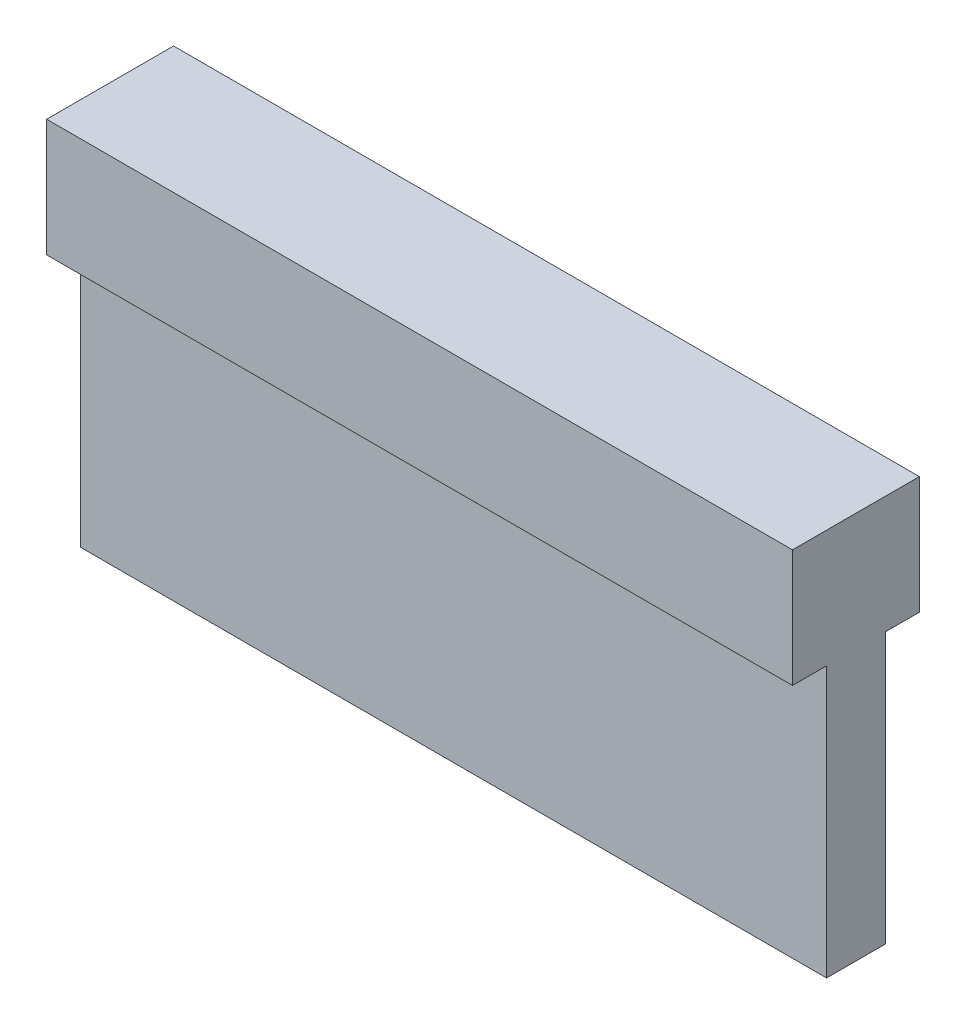
ISO-10303-21;
HEADER;
FILE_DESCRIPTION(('STEP AP214'),'2;1');
FILE_NAME('part.step','',(''),(''),'','','');
FILE_SCHEMA(('AUTOMOTIVE_DESIGN { 1 0 10303 214 1 1 1 1 }'));
ENDSEC;
DATA;
#1=APPLICATION_CONTEXT('core data for automotive mechanical design processes');
#2=APPLICATION_PROTOCOL_DEFINITION('international standard','automotive_design',2000,#1);
#3=PRODUCT_CONTEXT('',#1,'mechanical');
#4=PRODUCT('Part','Part','',(#3));
#5=PRODUCT_RELATED_PRODUCT_CATEGORY('part','',(#4));
#6=PRODUCT_DEFINITION_FORMATION('','',#4);
#7=PRODUCT_DEFINITION_CONTEXT('part definition',#1,'design');
#8=PRODUCT_DEFINITION('design','',#6,#7);
#9=PRODUCT_DEFINITION_SHAPE('','',#8);
#10=(LENGTH_UNIT() NAMED_UNIT(*) SI_UNIT(.MILLI.,.METRE.));
#11=(NAMED_UNIT(*) PLANE_ANGLE_UNIT() SI_UNIT($,.RADIAN.));
#12=(NAMED_UNIT(*) SI_UNIT($,.STERADIAN.) SOLID_ANGLE_UNIT());
#13=UNCERTAINTY_MEASURE_WITH_UNIT(LENGTH_MEASURE(1.E-05),#10,'distance_accuracy_value','');
#14=(GEOMETRIC_REPRESENTATION_CONTEXT(3) GLOBAL_UNCERTAINTY_ASSIGNED_CONTEXT((#13)) GLOBAL_UNIT_ASSIGNED_CONTEXT((#10,
#11,#12)) REPRESENTATION_CONTEXT('',''));
#15=CARTESIAN_POINT('',(0.,0.,0.));
#16=DIRECTION('',(0.,0.,1.));
#17=DIRECTION('',(1.,0.,0.));
#18=AXIS2_PLACEMENT_3D('',#15,#16,#17);
#19=CARTESIAN_POINT('',(31.75,-2.5,-1.25));
#20=DIRECTION('',(0.,1.,0.));
#21=DIRECTION('',(0.,0.,1.));
#22=AXIS2_PLACEMENT_3D('',#19,#20,#21);
#23=PLANE('',#22);
#24=DIRECTION('',(0.,0.,-1.));
#25=VECTOR('',#24,1.);
#26=CARTESIAN_POINT('',(0.,-2.5,-1.25));
#27=LINE('',#26,#25);
#28=CARTESIAN_POINT('',(0.,-2.5,-1.25));
#29=VERTEX_POINT('',#28);
#30=CARTESIAN_POINT('',(0.,-2.5,-2.70000000000002));
#31=VERTEX_POINT('',#30);
#32=EDGE_CURVE('E131',#29,#31,#27,.T.);
#33=ORIENTED_EDGE('',*,*,#32,.T.);
#34=DIRECTION('',(-1.,0.,0.));
#35=VECTOR('',#34,1.);
#36=CARTESIAN_POINT('',(31.75,-2.5,-2.70000000000002));
#37=LINE('',#36,#35);
#38=CARTESIAN_POINT('',(31.75,-2.5,-2.70000000000002));
#39=VERTEX_POINT('',#38);
#40=EDGE_CURVE('E11',#39,#31,#37,.T.);
#41=ORIENTED_EDGE('',*,*,#40,.F.);
#42=DIRECTION('',(0.,0.,-1.));
#43=VECTOR('',#42,1.);
#44=CARTESIAN_POINT('',(31.75,-2.5,-1.25));
#45=LINE('',#44,#43);
#46=CARTESIAN_POINT('',(31.75,-2.5,-1.25));
#47=VERTEX_POINT('',#46);
#48=EDGE_CURVE('E145',#47,#39,#45,.T.);
#49=ORIENTED_EDGE('',*,*,#48,.F.);
#50=DIRECTION('',(-1.,0.,0.));
#51=VECTOR('',#50,1.);
#52=CARTESIAN_POINT('',(31.75,-2.5,-1.25));
#53=LINE('',#52,#51);
#54=EDGE_CURVE('E127',#47,#29,#53,.T.);
#55=ORIENTED_EDGE('',*,*,#54,.T.);
#56=EDGE_LOOP('',(#33,#41,#49,#55));
#57=FACE_BOUND('',#56,.T.);
#58=ADVANCED_FACE('F35',(#57),#23,.F.);
#59=CARTESIAN_POINT('',(31.75,2.5,-2.70000000000002));
#60=DIRECTION('',(0.,0.,1.));
#61=DIRECTION('',(0.,-1.,0.));
#62=AXIS2_PLACEMENT_3D('',#59,#60,#61);
#63=PLANE('',#62);
#64=DIRECTION('',(0.,1.,0.));
#65=VECTOR('',#64,1.);
#66=CARTESIAN_POINT('',(0.,2.5,-2.70000000000002));
#67=LINE('',#66,#65);
#68=CARTESIAN_POINT('',(0.,2.5,-2.70000000000002));
#69=VERTEX_POINT('',#68);
#70=EDGE_CURVE('E134',#31,#69,#67,.T.);
#71=ORIENTED_EDGE('',*,*,#70,.T.);
#72=DIRECTION('',(-1.,0.,0.));
#73=VECTOR('',#72,1.);
#74=CARTESIAN_POINT('',(31.75,2.5,-2.70000000000002));
#75=LINE('',#74,#73);
#76=CARTESIAN_POINT('',(31.75,2.5,-2.70000000000002));
#77=VERTEX_POINT('',#76);
#78=EDGE_CURVE('E43',#77,#69,#75,.T.);
#79=ORIENTED_EDGE('',*,*,#78,.F.);
#80=DIRECTION('',(0.,1.,0.));
#81=VECTOR('',#80,1.);
#82=CARTESIAN_POINT('',(31.75,2.5,-2.70000000000002));
#83=LINE('',#82,#81);
#84=EDGE_CURVE('E94',#39,#77,#83,.T.);
#85=ORIENTED_EDGE('',*,*,#84,.F.);
#86=ORIENTED_EDGE('',*,*,#40,.T.);
#87=EDGE_LOOP('',(#71,#79,#85,#86));
#88=FACE_BOUND('',#87,.T.);
#89=ADVANCED_FACE('F180',(#88),#63,.F.);
#90=CARTESIAN_POINT('',(31.75,2.5,2.69999999999998));
#91=DIRECTION('',(0.,-1.,0.));
#92=DIRECTION('',(0.,0.,-1.));
#93=AXIS2_PLACEMENT_3D('',#90,#91,#92);
#94=PLANE('',#93);
#95=DIRECTION('',(0.,0.,1.));
#96=VECTOR('',#95,1.);
#97=CARTESIAN_POINT('',(0.,2.5,2.69999999999998));
#98=LINE('',#97,#96);
#99=CARTESIAN_POINT('',(0.,2.5,2.69999999999998));
#100=VERTEX_POINT('',#99);
#101=EDGE_CURVE('E136',#69,#100,#98,.T.);
#102=ORIENTED_EDGE('',*,*,#101,.T.);
#103=DIRECTION('',(-1.,0.,0.));
#104=VECTOR('',#103,1.);
#105=CARTESIAN_POINT('',(31.75,2.5,2.69999999999998));
#106=LINE('',#105,#104);
#107=CARTESIAN_POINT('',(31.75,2.5,2.69999999999998));
#108=VERTEX_POINT('',#107);
#109=EDGE_CURVE('E152',#108,#100,#106,.T.);
#110=ORIENTED_EDGE('',*,*,#109,.F.);
#111=DIRECTION('',(0.,0.,1.));
#112=VECTOR('',#111,1.);
#113=CARTESIAN_POINT('',(31.75,2.5,2.69999999999998));
#114=LINE('',#113,#112);
#115=EDGE_CURVE('E160',#77,#108,#114,.T.);
#116=ORIENTED_EDGE('',*,*,#115,.F.);
#117=ORIENTED_EDGE('',*,*,#78,.T.);
#118=EDGE_LOOP('',(#102,#110,#116,#117));
#119=FACE_BOUND('',#118,.T.);
#120=ADVANCED_FACE('F158',(#119),#94,.F.);
#121=CARTESIAN_POINT('',(31.75,2.5,2.69999999999998));
#122=DIRECTION('',(0.,0.,-1.));
#123=DIRECTION('',(0.,1.,0.));
#124=AXIS2_PLACEMENT_3D('',#121,#122,#123);
#125=PLANE('',#124);
#126=DIRECTION('',(0.,-1.,0.));
#127=VECTOR('',#126,1.);
#128=CARTESIAN_POINT('',(0.,2.5,2.69999999999998));
#129=LINE('',#128,#127);
#130=CARTESIAN_POINT('',(0.,-2.5,2.69999999999998));
#131=VERTEX_POINT('',#130);
#132=EDGE_CURVE('E138',#100,#131,#129,.T.);
#133=ORIENTED_EDGE('',*,*,#132,.T.);
#134=DIRECTION('',(-1.,0.,0.));
#135=VECTOR('',#134,1.);
#136=CARTESIAN_POINT('',(31.75,-2.5,2.69999999999998));
#137=LINE('',#136,#135);
#138=CARTESIAN_POINT('',(31.75,-2.5,2.69999999999998));
#139=VERTEX_POINT('',#138);
#140=EDGE_CURVE('E149',#139,#131,#137,.T.);
#141=ORIENTED_EDGE('',*,*,#140,.F.);
#142=DIRECTION('',(0.,-1.,0.));
#143=VECTOR('',#142,1.);
#144=CARTESIAN_POINT('',(31.75,2.5,2.69999999999998));
#145=LINE('',#144,#143);
#146=EDGE_CURVE('E172',#108,#139,#145,.T.);
#147=ORIENTED_EDGE('',*,*,#146,.F.);
#148=ORIENTED_EDGE('',*,*,#109,.T.);
#149=EDGE_LOOP('',(#133,#141,#147,#148));
#150=FACE_BOUND('',#149,.T.);
#151=ADVANCED_FACE('F168',(#150),#125,.F.);
#152=CARTESIAN_POINT('',(31.75,-2.5,2.69999999999998));
#153=DIRECTION('',(0.,1.,0.));
#154=DIRECTION('',(0.,0.,1.));
#155=AXIS2_PLACEMENT_3D('',#152,#153,#154);
#156=PLANE('',#155);
#157=DIRECTION('',(0.,0.,-1.));
#158=VECTOR('',#157,1.);
#159=CARTESIAN_POINT('',(0.,-2.5,2.69999999999998));
#160=LINE('',#159,#158);
#161=CARTESIAN_POINT('',(0.,-2.5,1.25));
#162=VERTEX_POINT('',#161);
#163=EDGE_CURVE('E140',#131,#162,#160,.T.);
#164=ORIENTED_EDGE('',*,*,#163,.T.);
#165=DIRECTION('',(-1.,0.,0.));
#166=VECTOR('',#165,1.);
#167=CARTESIAN_POINT('',(31.75,-2.5,1.25));
#168=LINE('',#167,#166);
#169=CARTESIAN_POINT('',(31.75,-2.5,1.25));
#170=VERTEX_POINT('',#169);
#171=EDGE_CURVE('E122',#170,#162,#168,.T.);
#172=ORIENTED_EDGE('',*,*,#171,.F.);
#173=DIRECTION('',(0.,0.,-1.));
#174=VECTOR('',#173,1.);
#175=CARTESIAN_POINT('',(31.75,-2.5,2.69999999999998));
#176=LINE('',#175,#174);
#177=EDGE_CURVE('E113',#139,#170,#176,.T.);
#178=ORIENTED_EDGE('',*,*,#177,.F.);
#179=ORIENTED_EDGE('',*,*,#140,.T.);
#180=EDGE_LOOP('',(#164,#172,#178,#179));
#181=FACE_BOUND('',#180,.T.);
#182=ADVANCED_FACE('F171',(#181),#156,.F.);
#183=CARTESIAN_POINT('',(31.75,-2.5,1.25));
#184=DIRECTION('',(0.,0.,-1.));
#185=DIRECTION('',(-1.,0.,0.));
#186=AXIS2_PLACEMENT_3D('',#183,#184,#185);
#187=PLANE('',#186);
#188=DIRECTION('',(0.,-1.,0.));
#189=VECTOR('',#188,1.);
#190=CARTESIAN_POINT('',(0.,-2.5,1.25));
#191=LINE('',#190,#189);
#192=CARTESIAN_POINT('',(0.,-14.01,1.25));
#193=VERTEX_POINT('',#192);
#194=EDGE_CURVE('E121',#162,#193,#191,.T.);
#195=ORIENTED_EDGE('',*,*,#194,.T.);
#196=DIRECTION('',(-1.,0.,0.));
#197=VECTOR('',#196,1.);
#198=CARTESIAN_POINT('',(31.75,-14.01,1.25));
#199=LINE('',#198,#197);
#200=CARTESIAN_POINT('',(31.75,-14.01,1.25));
#201=VERTEX_POINT('',#200);
#202=EDGE_CURVE('E118',#201,#193,#199,.T.);
#203=ORIENTED_EDGE('',*,*,#202,.F.);
#204=DIRECTION('',(0.,-1.,0.));
#205=VECTOR('',#204,1.);
#206=CARTESIAN_POINT('',(31.75,-2.5,1.25));
#207=LINE('',#206,#205);
#208=EDGE_CURVE('E107',#170,#201,#207,.T.);
#209=ORIENTED_EDGE('',*,*,#208,.F.);
#210=ORIENTED_EDGE('',*,*,#171,.T.);
#211=EDGE_LOOP('',(#195,#203,#209,#210));
#212=FACE_BOUND('',#211,.T.);
#213=ADVANCED_FACE('F119',(#212),#187,.F.);
#214=CARTESIAN_POINT('',(31.75,-14.01,1.25));
#215=DIRECTION('',(0.,1.,0.));
#216=DIRECTION('',(0.,0.,1.));
#217=AXIS2_PLACEMENT_3D('',#214,#215,#216);
#218=PLANE('',#217);
#219=DIRECTION('',(0.,0.,-1.));
#220=VECTOR('',#219,1.);
#221=CARTESIAN_POINT('',(0.,-14.01,1.25));
#222=LINE('',#221,#220);
#223=CARTESIAN_POINT('',(0.,-14.01,-1.25));
#224=VERTEX_POINT('',#223);
#225=EDGE_CURVE('E80',#193,#224,#222,.T.);
#226=ORIENTED_EDGE('',*,*,#225,.T.);
#227=DIRECTION('',(-1.,0.,0.));
#228=VECTOR('',#227,1.);
#229=CARTESIAN_POINT('',(31.75,-14.01,-1.25));
#230=LINE('',#229,#228);
#231=CARTESIAN_POINT('',(31.75,-14.01,-1.25));
#232=VERTEX_POINT('',#231);
#233=EDGE_CURVE('E123',#232,#224,#230,.T.);
#234=ORIENTED_EDGE('',*,*,#233,.F.);
#235=DIRECTION('',(0.,0.,-1.));
#236=VECTOR('',#235,1.);
#237=CARTESIAN_POINT('',(31.75,-14.01,1.25));
#238=LINE('',#237,#236);
#239=EDGE_CURVE('E111',#201,#232,#238,.T.);
#240=ORIENTED_EDGE('',*,*,#239,.F.);
#241=ORIENTED_EDGE('',*,*,#202,.T.);
#242=EDGE_LOOP('',(#226,#234,#240,#241));
#243=FACE_BOUND('',#242,.T.);
#244=ADVANCED_FACE('F125',(#243),#218,.F.);
#245=CARTESIAN_POINT('',(31.75,-14.01,-1.25));
#246=DIRECTION('',(0.,0.,1.));
#247=DIRECTION('',(1.,0.,0.));
#248=AXIS2_PLACEMENT_3D('',#245,#246,#247);
#249=PLANE('',#248);
#250=DIRECTION('',(0.,1.,0.));
#251=VECTOR('',#250,1.);
#252=CARTESIAN_POINT('',(0.,-14.01,-1.25));
#253=LINE('',#252,#251);
#254=EDGE_CURVE('E86',#224,#29,#253,.T.);
#255=ORIENTED_EDGE('',*,*,#254,.T.);
#256=ORIENTED_EDGE('',*,*,#54,.F.);
#257=DIRECTION('',(0.,1.,0.));
#258=VECTOR('',#257,1.);
#259=CARTESIAN_POINT('',(31.75,-14.01,-1.25));
#260=LINE('',#259,#258);
#261=EDGE_CURVE('E51',#232,#47,#260,.T.);
#262=ORIENTED_EDGE('',*,*,#261,.F.);
#263=ORIENTED_EDGE('',*,*,#233,.T.);
#264=EDGE_LOOP('',(#255,#256,#262,#263));
#265=FACE_BOUND('',#264,.T.);
#266=ADVANCED_FACE('F196',(#265),#249,.F.);
#267=CARTESIAN_POINT('',(31.75,0.,0.));
#268=DIRECTION('',(-1.,0.,0.));
#269=DIRECTION('',(0.,0.,1.));
#270=AXIS2_PLACEMENT_3D('',#267,#268,#269);
#271=PLANE('',#270);
#272=ORIENTED_EDGE('',*,*,#48,.T.);
#273=ORIENTED_EDGE('',*,*,#84,.T.);
#274=ORIENTED_EDGE('',*,*,#115,.T.);
#275=ORIENTED_EDGE('',*,*,#146,.T.);
#276=ORIENTED_EDGE('',*,*,#177,.T.);
#277=ORIENTED_EDGE('',*,*,#208,.T.);
#278=ORIENTED_EDGE('',*,*,#239,.T.);
#279=ORIENTED_EDGE('',*,*,#261,.T.);
#280=EDGE_LOOP('',(#272,#273,#274,#275,#276,#277,#278,#279));
#281=FACE_BOUND('',#280,.T.);
#282=ADVANCED_FACE('F109',(#281),#271,.F.);
#283=CARTESIAN_POINT('',(0.,0.,0.));
#284=DIRECTION('',(-1.,0.,0.));
#285=DIRECTION('',(0.,0.,1.));
#286=AXIS2_PLACEMENT_3D('',#283,#284,#285);
#287=PLANE('',#286);
#288=ORIENTED_EDGE('',*,*,#32,.F.);
#289=ORIENTED_EDGE('',*,*,#254,.F.);
#290=ORIENTED_EDGE('',*,*,#225,.F.);
#291=ORIENTED_EDGE('',*,*,#194,.F.);
#292=ORIENTED_EDGE('',*,*,#163,.F.);
#293=ORIENTED_EDGE('',*,*,#132,.F.);
#294=ORIENTED_EDGE('',*,*,#101,.F.);
#295=ORIENTED_EDGE('',*,*,#70,.F.);
#296=EDGE_LOOP('',(#288,#289,#290,#291,#292,#293,#294,#295));
#297=FACE_BOUND('',#296,.T.);
#298=ADVANCED_FACE('F164',(#297),#287,.T.);
#299=CLOSED_SHELL('',(#58,#89,#120,#151,#182,#213,#244,#266,#282,#298));
#300=MANIFOLD_SOLID_BREP('B2',#299);
#301=ADVANCED_BREP_SHAPE_REPRESENTATION('',(#18,#300),#14);
#302=SHAPE_DEFINITION_REPRESENTATION(#9,#301);
ENDSEC;
END-ISO-10303-21;
